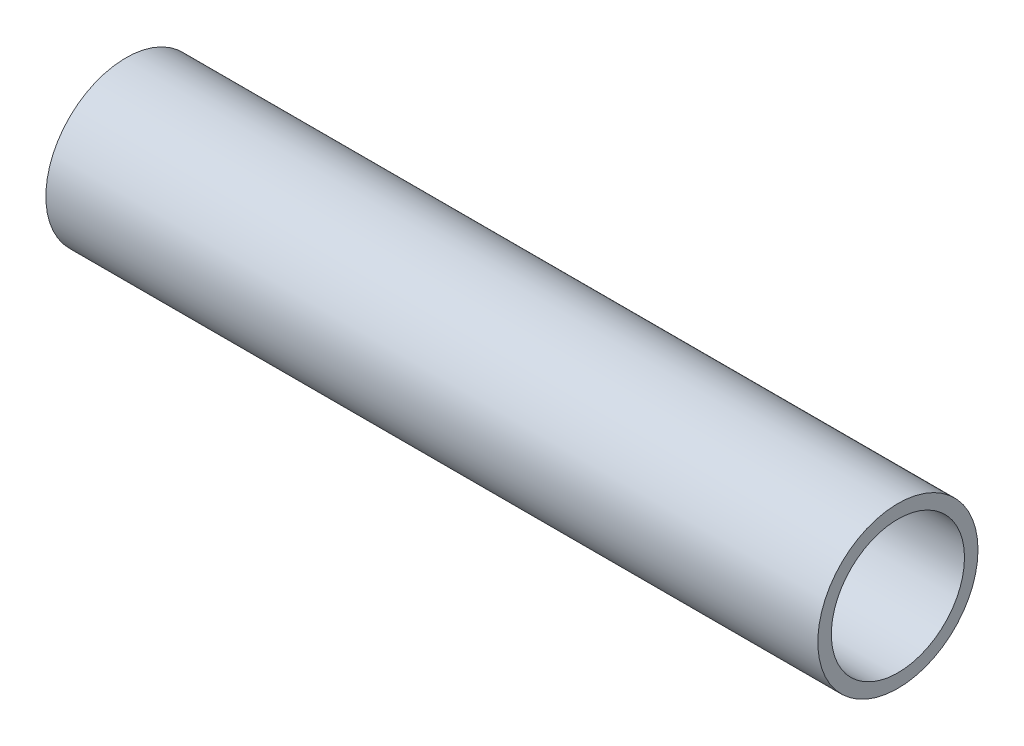
ISO-10303-21;
HEADER;
FILE_DESCRIPTION(('STEP AP214'),'2;1');
FILE_NAME('part.step','',(''),(''),'','','');
FILE_SCHEMA(('AUTOMOTIVE_DESIGN { 1 0 10303 214 1 1 1 1 }'));
ENDSEC;
DATA;
#1=APPLICATION_CONTEXT('core data for automotive mechanical design processes');
#2=APPLICATION_PROTOCOL_DEFINITION('international standard','automotive_design',2000,#1);
#3=PRODUCT_CONTEXT('',#1,'mechanical');
#4=PRODUCT('Part','Part','',(#3));
#5=PRODUCT_RELATED_PRODUCT_CATEGORY('part','',(#4));
#6=PRODUCT_DEFINITION_FORMATION('','',#4);
#7=PRODUCT_DEFINITION_CONTEXT('part definition',#1,'design');
#8=PRODUCT_DEFINITION('design','',#6,#7);
#9=PRODUCT_DEFINITION_SHAPE('','',#8);
#10=(LENGTH_UNIT() NAMED_UNIT(*) SI_UNIT(.MILLI.,.METRE.));
#11=(NAMED_UNIT(*) PLANE_ANGLE_UNIT() SI_UNIT($,.RADIAN.));
#12=(NAMED_UNIT(*) SI_UNIT($,.STERADIAN.) SOLID_ANGLE_UNIT());
#13=UNCERTAINTY_MEASURE_WITH_UNIT(LENGTH_MEASURE(1.E-05),#10,'distance_accuracy_value','');
#14=(GEOMETRIC_REPRESENTATION_CONTEXT(3) GLOBAL_UNCERTAINTY_ASSIGNED_CONTEXT((#13)) GLOBAL_UNIT_ASSIGNED_CONTEXT((#10,
#11,#12)) REPRESENTATION_CONTEXT('',''));
#15=CARTESIAN_POINT('',(0.,0.,0.));
#16=DIRECTION('',(0.,0.,1.));
#17=DIRECTION('',(1.,0.,0.));
#18=AXIS2_PLACEMENT_3D('',#15,#16,#17);
#19=CARTESIAN_POINT('',(23.8125,0.,0.));
#20=DIRECTION('',(0.,0.,-1.));
#21=DIRECTION('',(-1.,0.,0.));
#22=AXIS2_PLACEMENT_3D('',#19,#20,#21);
#23=CYLINDRICAL_SURFACE('',#22,2.4892);
#24=CARTESIAN_POINT('',(21.3233,0.,-17.526));
#25=CARTESIAN_POINT('',(21.3233062266169,-0.138938254931943,-17.5259977726248));
#26=CARTESIAN_POINT('',(21.3349813067063,-0.278056737041307,-17.5243291328847));
#27=CARTESIAN_POINT('',(21.3813911470445,-0.5525107717604,-17.5178292183779));
#28=CARTESIAN_POINT('',(21.4161734268432,-0.687837928648226,-17.512991426592));
#29=CARTESIAN_POINT('',(21.5077463863515,-0.950548988753154,-17.5006972156485));
#30=CARTESIAN_POINT('',(21.5645120778191,-1.07794172075063,-17.4932437705673));
#31=CARTESIAN_POINT('',(21.6983863175126,-1.32133653487949,-17.4765455887316));
#32=CARTESIAN_POINT('',(21.7754867392916,-1.4373431419368,-17.4673015679429));
#33=CARTESIAN_POINT('',(21.9484360487788,-1.65556227287108,-17.4479764750468));
#34=CARTESIAN_POINT('',(22.0444015414688,-1.75768195837013,-17.4378904336395));
#35=CARTESIAN_POINT('',(22.2521103856718,-1.94443010223313,-17.4180569830886));
#36=CARTESIAN_POINT('',(22.3638554036207,-2.02905671086871,-17.4083096098464));
#37=CARTESIAN_POINT('',(22.6005526819453,-2.1787595375816,-17.3902102827199));
#38=CARTESIAN_POINT('',(22.7255605656716,-2.2437486351899,-17.3818646180092));
#39=CARTESIAN_POINT('',(22.9848542436352,-2.35177419772773,-17.3675796065219));
#40=CARTESIAN_POINT('',(23.1191395034592,-2.39481192594698,-17.3616401212749));
#41=CARTESIAN_POINT('',(23.3922200685526,-2.45743213756116,-17.3528875502091));
#42=CARTESIAN_POINT('',(23.5309789813206,-2.47717037235337,-17.3500537131269));
#43=CARTESIAN_POINT('',(23.8098665327033,-2.49311360225913,-17.347770156121));
#44=CARTESIAN_POINT('',(23.9499951026768,-2.48931977072165,-17.3483202674678));
#45=CARTESIAN_POINT('',(24.2265474932383,-2.45843410030657,-17.3527234598054));
#46=CARTESIAN_POINT('',(24.3629910845748,-2.43151529098414,-17.3565520096389));
#47=CARTESIAN_POINT('',(24.6294060939256,-2.35541394562813,-17.3670424544746));
#48=CARTESIAN_POINT('',(24.7593772905789,-2.30623064871123,-17.3737044463084));
#49=CARTESIAN_POINT('',(25.0096911083541,-2.18681258648927,-17.3891387400983));
#50=CARTESIAN_POINT('',(25.1299976490672,-2.1165031963891,-17.3979185007095));
#51=CARTESIAN_POINT('',(25.3571607779271,-1.95688798280617,-17.4165926739363));
#52=CARTESIAN_POINT('',(25.4640176427523,-1.86758255019977,-17.4264870636145));
#53=CARTESIAN_POINT('',(25.6622435793958,-1.67157524535651,-17.4463829999866));
#54=CARTESIAN_POINT('',(25.7534686545121,-1.56472772059487,-17.4563847256321));
#55=CARTESIAN_POINT('',(25.9167550962461,-1.33710469447356,-17.4752924830594));
#56=CARTESIAN_POINT('',(25.988807768252,-1.21632290945262,-17.4841980167419));
#57=CARTESIAN_POINT('',(26.1117019761684,-0.964108046753343,-17.4999187345503));
#58=CARTESIAN_POINT('',(26.1625156561356,-0.832661249377181,-17.5067311703982));
#59=CARTESIAN_POINT('',(26.2412034012792,-0.563157851747397,-17.5174660851217));
#60=CARTESIAN_POINT('',(26.2691259522255,-0.425115880966423,-17.5213946704331));
#61=CARTESIAN_POINT('',(26.2907176883334,-0.238423058702268,-17.524443161174));
#62=CARTESIAN_POINT('',(26.294832866381,-0.190839329349158,-17.5250257692345));
#63=CARTESIAN_POINT('',(26.3003250932782,-0.0955108339760813,-17.5258045716289));
#64=CARTESIAN_POINT('',(26.3017021406704,-0.0477660678704195,-17.5260007657571));
#65=CARTESIAN_POINT('',(26.3016937733831,0.138938254931942,-17.5259977726248));
#66=CARTESIAN_POINT('',(26.2900186932937,0.278056737041305,-17.5243291328847));
#67=CARTESIAN_POINT('',(26.2436088529555,0.552510771760398,-17.5178292183779));
#68=CARTESIAN_POINT('',(26.2088265731568,0.687837928648224,-17.512991426592));
#69=CARTESIAN_POINT('',(26.1172536136485,0.950548988753152,-17.5006972156485));
#70=CARTESIAN_POINT('',(26.0604879221809,1.07794172075063,-17.4932437705673));
#71=CARTESIAN_POINT('',(25.9266136824874,1.32133653487949,-17.4765455887316));
#72=CARTESIAN_POINT('',(25.8495132607084,1.4373431419368,-17.4673015679429));
#73=CARTESIAN_POINT('',(25.6765639512212,1.65556227287108,-17.4479764750468));
#74=CARTESIAN_POINT('',(25.5805984585312,1.75768195837013,-17.4378904336395));
#75=CARTESIAN_POINT('',(25.3728896143282,1.94443010223313,-17.4180569830886));
#76=CARTESIAN_POINT('',(25.2611445963793,2.02905671086871,-17.4083096098464));
#77=CARTESIAN_POINT('',(25.0244473180547,2.1787595375816,-17.3902102827199));
#78=CARTESIAN_POINT('',(24.8994394343284,2.2437486351899,-17.3818646180092));
#79=CARTESIAN_POINT('',(24.6401457563648,2.35177419772773,-17.3675796065219));
#80=CARTESIAN_POINT('',(24.5058604965408,2.39481192594698,-17.3616401212749));
#81=CARTESIAN_POINT('',(24.2327799314474,2.45743213756116,-17.3528875502091));
#82=CARTESIAN_POINT('',(24.0940210186794,2.47717037235337,-17.3500537131269));
#83=CARTESIAN_POINT('',(23.8151334672967,2.49311360225913,-17.347770156121));
#84=CARTESIAN_POINT('',(23.6750048973232,2.48931977072165,-17.3483202674678));
#85=CARTESIAN_POINT('',(23.3984525067617,2.45843410030657,-17.3527234598054));
#86=CARTESIAN_POINT('',(23.2620089154252,2.43151529098414,-17.3565520096389));
#87=CARTESIAN_POINT('',(22.9955939060744,2.35541394562813,-17.3670424544746));
#88=CARTESIAN_POINT('',(22.8656227094211,2.30623064871123,-17.3737044463084));
#89=CARTESIAN_POINT('',(22.6153088916459,2.18681258648928,-17.3891387400983));
#90=CARTESIAN_POINT('',(22.4950023509328,2.1165031963891,-17.3979185007095));
#91=CARTESIAN_POINT('',(22.2678392220729,1.95688798280617,-17.4165926739363));
#92=CARTESIAN_POINT('',(22.1609823572477,1.86758255019977,-17.4264870636145));
#93=CARTESIAN_POINT('',(21.9627564206042,1.67157524535651,-17.4463829999866));
#94=CARTESIAN_POINT('',(21.8715313454879,1.56472772059487,-17.4563847256321));
#95=CARTESIAN_POINT('',(21.7082449037539,1.33710469447356,-17.4752924830594));
#96=CARTESIAN_POINT('',(21.636192231748,1.21632290945262,-17.4841980167419));
#97=CARTESIAN_POINT('',(21.5132980238316,0.964108046753344,-17.4999187345503));
#98=CARTESIAN_POINT('',(21.4624843438644,0.83266124937718,-17.5067311703982));
#99=CARTESIAN_POINT('',(21.3837965987208,0.563157851747397,-17.5174660851217));
#100=CARTESIAN_POINT('',(21.3558740477745,0.425115880966424,-17.5213946704331));
#101=CARTESIAN_POINT('',(21.3342823116666,0.238423058702268,-17.524443161174));
#102=CARTESIAN_POINT('',(21.330167133619,0.190839329349158,-17.5250257692345));
#103=CARTESIAN_POINT('',(21.3246749067218,0.0955108339760801,-17.5258045716289));
#104=CARTESIAN_POINT('',(21.3232978593296,0.0477660678704179,-17.5260007657571));
#105=CARTESIAN_POINT('',(21.3233,0.,-17.526));
#106=B_SPLINE_CURVE_WITH_KNOTS('',3,(#24,#25,#26,#27,#28,#29,#30,#31,#32,#33,#34,#35,#36,#37,
#38,#39,#40,#41,#42,#43,#44,#45,#46,#47,#48,#49,#50,#51,#52,#53,#54,#55,#56,#57,#58,#59,#60,#61,
#62,#63,#64,#65,#66,#67,#68,#69,#70,#71,#72,#73,#74,#75,#76,#77,#78,#79,#80,#81,#82,#83,#84,#85,
#86,#87,#88,#89,#90,#91,#92,#93,#94,#95,#96,#97,#98,#99,#100,#101,#102,#103,#104,#105),
.UNSPECIFIED.,.T.,.F.,(4,2,2,2,2,2,2,2,2,2,2,2,2,2,2,2,2,2,2,2,2,2,2,2,2,2,2,2,2,2,2,2,2,2,2,2,
2,2,2,2,4),(0.,0.416632621256299,0.834124703436849,1.25114361445184,1.66799612244714,
2.08751115533074,2.50707052531723,2.92846479975324,3.34983482043377,3.76837184084957,
4.18688799246334,4.60229965981692,5.01772552483293,5.43463642470698,5.85153874674943,
6.27209610359054,6.69284385779425,7.11414172405143,7.53454491553811,7.67778042315222,
7.82101600699993,8.23764862825623,8.65514071043678,9.07215962145176,9.48901212944707,
9.90852716233067,10.3280865323172,10.7494808067532,11.1708508274337,11.5893878478495,
12.0079039994633,12.4233156668168,12.8387415318328,13.2556524317069,13.6725547537494,
14.0931121105905,14.5138598647942,14.9351577310514,15.355560922538,15.4987964301521,
15.6420320139999),.UNSPECIFIED.);
#107=CARTESIAN_POINT('',(21.3233,0.,-17.526));
#108=VERTEX_POINT('',#107);
#109=EDGE_CURVE('E19',#108,#108,#106,.T.);
#110=ORIENTED_EDGE('',*,*,#109,.T.);
#111=EDGE_LOOP('',(#110));
#112=FACE_BOUND('',#111,.T.);
#113=CARTESIAN_POINT('',(26.3017,0.,-21.082));
#114=CARTESIAN_POINT('',(26.3016939093136,0.13917324253647,-21.0819981655476));
#115=CARTESIAN_POINT('',(26.2899795838816,0.278529433631494,-21.0806062227581));
#116=CARTESIAN_POINT('',(26.2434064099311,0.553464384706544,-21.0751843948127));
#117=CARTESIAN_POINT('',(26.208499288281,0.689034650147752,-21.0711490078797));
#118=CARTESIAN_POINT('',(26.1165753485475,0.952234680958764,-21.0608949848637));
#119=CARTESIAN_POINT('',(26.0595816147232,1.07987257591295,-21.0546786289036));
#120=CARTESIAN_POINT('',(25.9251488690771,1.32371155335375,-21.0407567449483));
#121=CARTESIAN_POINT('',(25.8477184835385,1.43991743293608,-21.0330518456322));
#122=CARTESIAN_POINT('',(25.6741860255696,1.65824366359407,-21.0169694889126));
#123=CARTESIAN_POINT('',(25.5780015098688,1.76029828618129,-21.008589161403));
#124=CARTESIAN_POINT('',(25.3698636589191,1.94686149327507,-20.9921234801541));
#125=CARTESIAN_POINT('',(25.2579087642175,2.03136834052416,-20.9840381556858));
#126=CARTESIAN_POINT('',(25.0210003728574,2.18066596797703,-20.9690506836339));
#127=CARTESIAN_POINT('',(24.8960092533975,2.24539743866397,-20.9621521218544));
#128=CARTESIAN_POINT('',(24.636836779057,2.35292726459425,-20.9503556287517));
#129=CARTESIAN_POINT('',(24.5026558165181,2.39572655552658,-20.9454576120813));
#130=CARTESIAN_POINT('',(24.2295758482469,2.45798388401387,-20.9382431663173));
#131=CARTESIAN_POINT('',(24.0907017987014,2.47754997869918,-20.9359147894799));
#132=CARTESIAN_POINT('',(23.8116228664883,2.49311975385867,-20.9340665629629));
#133=CARTESIAN_POINT('',(23.6714180296102,2.48912424212237,-20.9345466169986));
#134=CARTESIAN_POINT('',(23.3944095773965,2.45777309723949,-20.9382500748012));
#135=CARTESIAN_POINT('',(23.2575922890195,2.43053639079988,-20.9414595118558));
#136=CARTESIAN_POINT('',(22.9904828756884,2.35366098786401,-20.9502383704882));
#137=CARTESIAN_POINT('',(22.8601909280201,2.30402168308216,-20.9558078561469));
#138=CARTESIAN_POINT('',(22.6094565456649,2.18361936461013,-20.9686954057668));
#139=CARTESIAN_POINT('',(22.4890396571697,2.11280363705816,-20.9760178240728));
#140=CARTESIAN_POINT('',(22.2617641579912,1.95210261660065,-20.9915819783994));
#141=CARTESIAN_POINT('',(22.1549049972902,1.86221809768415,-20.9998236771006));
#142=CARTESIAN_POINT('',(21.9570955918468,1.66528844379043,-21.0163588445672));
#143=CARTESIAN_POINT('',(21.8662441854619,1.55814401335078,-21.0246523285127));
#144=CARTESIAN_POINT('',(21.7037583149481,1.33001488761703,-21.0403144982853));
#145=CARTESIAN_POINT('',(21.6321326799525,1.20902386975035,-21.0476827583939));
#146=CARTESIAN_POINT('',(21.5101404950765,0.956530753400546,-21.0606687789238));
#147=CARTESIAN_POINT('',(21.4597973876999,0.825017253075612,-21.0662846072851));
#148=CARTESIAN_POINT('',(21.3820408340219,0.555500835671919,-21.0751091304543));
#149=CARTESIAN_POINT('',(21.3545788189882,0.417512324356258,-21.0783229224621));
#150=CARTESIAN_POINT('',(21.3337112882718,0.232154861972339,-21.0807729691146));
#151=CARTESIAN_POINT('',(21.3298099821497,0.185816598413804,-21.0812321786978));
#152=CARTESIAN_POINT('',(21.3246033199595,0.0929923662024417,-21.0818460006914));
#153=CARTESIAN_POINT('',(21.3232979647246,0.046506397502218,-21.0820006130041));
#154=CARTESIAN_POINT('',(21.3233060906864,-0.139173242536472,-21.0819981655476));
#155=CARTESIAN_POINT('',(21.3350204161184,-0.278529433631496,-21.0806062227581));
#156=CARTESIAN_POINT('',(21.3815935900689,-0.553464384706546,-21.0751843948127));
#157=CARTESIAN_POINT('',(21.416500711719,-0.689034650147754,-21.0711490078797));
#158=CARTESIAN_POINT('',(21.5084246514525,-0.952234680958766,-21.0608949848637));
#159=CARTESIAN_POINT('',(21.5654183852768,-1.07987257591295,-21.0546786289036));
#160=CARTESIAN_POINT('',(21.6998511309229,-1.32371155335375,-21.0407567449483));
#161=CARTESIAN_POINT('',(21.7772815164615,-1.43991743293608,-21.0330518456322));
#162=CARTESIAN_POINT('',(21.9508139744304,-1.65824366359407,-21.0169694889126));
#163=CARTESIAN_POINT('',(22.0469984901312,-1.7602982861813,-21.008589161403));
#164=CARTESIAN_POINT('',(22.2551363410809,-1.94686149327508,-20.9921234801541));
#165=CARTESIAN_POINT('',(22.3670912357826,-2.03136834052417,-20.9840381556858));
#166=CARTESIAN_POINT('',(22.6039996271426,-2.18066596797703,-20.9690506836339));
#167=CARTESIAN_POINT('',(22.7289907466025,-2.24539743866397,-20.9621521218544));
#168=CARTESIAN_POINT('',(22.988163220943,-2.35292726459425,-20.9503556287517));
#169=CARTESIAN_POINT('',(23.1223441834819,-2.39572655552658,-20.9454576120813));
#170=CARTESIAN_POINT('',(23.3954241517531,-2.45798388401387,-20.9382431663173));
#171=CARTESIAN_POINT('',(23.5342982012986,-2.47754997869918,-20.9359147894799));
#172=CARTESIAN_POINT('',(23.8133771335117,-2.49311975385867,-20.9340665629629));
#173=CARTESIAN_POINT('',(23.9535819703898,-2.48912424212237,-20.9345466169986));
#174=CARTESIAN_POINT('',(24.2305904226035,-2.45777309723949,-20.9382500748012));
#175=CARTESIAN_POINT('',(24.3674077109805,-2.43053639079988,-20.9414595118558));
#176=CARTESIAN_POINT('',(24.6345171243116,-2.35366098786401,-20.9502383704882));
#177=CARTESIAN_POINT('',(24.7648090719799,-2.30402168308215,-20.9558078561469));
#178=CARTESIAN_POINT('',(25.0155434543351,-2.18361936461013,-20.9686954057668));
#179=CARTESIAN_POINT('',(25.1359603428303,-2.11280363705816,-20.9760178240728));
#180=CARTESIAN_POINT('',(25.3632358420088,-1.95210261660065,-20.9915819783994));
#181=CARTESIAN_POINT('',(25.4700950027098,-1.86221809768415,-20.9998236771006));
#182=CARTESIAN_POINT('',(25.6679044081532,-1.66528844379043,-21.0163588445672));
#183=CARTESIAN_POINT('',(25.7587558145381,-1.55814401335078,-21.0246523285127));
#184=CARTESIAN_POINT('',(25.9212416850519,-1.33001488761702,-21.0403144982853));
#185=CARTESIAN_POINT('',(25.9928673200475,-1.20902386975035,-21.0476827583939));
#186=CARTESIAN_POINT('',(26.1148595049235,-0.956530753400542,-21.0606687789238));
#187=CARTESIAN_POINT('',(26.1652026123001,-0.825017253075607,-21.0662846072851));
#188=CARTESIAN_POINT('',(26.2429591659781,-0.555500835671915,-21.0751091304543));
#189=CARTESIAN_POINT('',(26.2704211810119,-0.417512324356256,-21.0783229224621));
#190=CARTESIAN_POINT('',(26.2912887117282,-0.232154861972337,-21.0807729691146));
#191=CARTESIAN_POINT('',(26.2951900178503,-0.185816598413804,-21.0812321786978));
#192=CARTESIAN_POINT('',(26.3003966800405,-0.0929923662024424,-21.0818460006914));
#193=CARTESIAN_POINT('',(26.3017020352754,-0.0465063975022194,-21.0820006130041));
#194=CARTESIAN_POINT('',(26.3017,0.,-21.082));
#195=B_SPLINE_CURVE_WITH_KNOTS('',3,(#113,#114,#115,#116,#117,#118,#119,#120,#121,#122,#123,
#124,#125,#126,#127,#128,#129,#130,#131,#132,#133,#134,#135,#136,#137,#138,#139,#140,#141,#142,
#143,#144,#145,#146,#147,#148,#149,#150,#151,#152,#153,#154,#155,#156,#157,#158,#159,#160,#161,
#162,#163,#164,#165,#166,#167,#168,#169,#170,#171,#172,#173,#174,#175,#176,#177,#178,#179,#180,
#181,#182,#183,#184,#185,#186,#187,#188,#189,#190,#191,#192,#193,#194),.UNSPECIFIED.,.T.,.F.,(4,
2,2,2,2,2,2,2,2,2,2,2,2,2,2,2,2,2,2,2,2,2,2,2,2,2,2,2,2,2,2,2,2,2,2,2,2,2,2,2,4),(0.,
0.417342531698613,0.835556446393463,1.25333443033391,1.67093635198848,2.09041721847861,
2.50993959445756,2.93070810484587,3.35145866256164,3.77024455574891,4.1890160913035,
4.60565750829793,5.02231023881106,5.44000888913396,5.85769058860035,6.27786714988648,
6.69823634180109,7.11906736753133,7.53900282062446,7.6784627562516,7.81792273663304,
8.23526526833165,8.6534791830265,9.07125716696695,9.48885908862152,9.90833995511165,
10.3278623310906,10.7486308414789,11.1693813991947,11.5881672923819,12.0069388279365,
12.423580244931,12.8402329754441,13.257931625767,13.6756133252334,14.0957898865195,
14.5161590784341,14.9369901041644,15.3569255572575,15.4963854928846,15.6358454732661),.UNSPECIFIED.);
#196=CARTESIAN_POINT('',(26.3017,0.,-21.082));
#197=VERTEX_POINT('',#196);
#198=EDGE_CURVE('E42',#197,#197,#195,.T.);
#199=ORIENTED_EDGE('',*,*,#198,.F.);
#200=EDGE_LOOP('',(#199));
#201=FACE_BOUND('',#200,.T.);
#202=ADVANCED_FACE('F15',(#112,#201),#23,.F.);
#203=CARTESIAN_POINT('',(-23.8125,0.,0.));
#204=DIRECTION('',(0.,0.,1.));
#205=DIRECTION('',(1.,0.,0.));
#206=AXIS2_PLACEMENT_3D('',#203,#204,#205);
#207=CYLINDRICAL_SURFACE('',#206,2.4892);
#208=CARTESIAN_POINT('',(-21.3233,0.,-21.082));
#209=CARTESIAN_POINT('',(-21.3233060906864,0.13917324253647,-21.0819981655476));
#210=CARTESIAN_POINT('',(-21.3350204161184,0.278529433631494,-21.0806062227581));
#211=CARTESIAN_POINT('',(-21.3815935900689,0.553464384706544,-21.0751843948127));
#212=CARTESIAN_POINT('',(-21.416500711719,0.689034650147752,-21.0711490078797));
#213=CARTESIAN_POINT('',(-21.5084246514525,0.952234680958762,-21.0608949848637));
#214=CARTESIAN_POINT('',(-21.5654183852768,1.07987257591295,-21.0546786289036));
#215=CARTESIAN_POINT('',(-21.6998511309229,1.32371155335375,-21.0407567449483));
#216=CARTESIAN_POINT('',(-21.7772815164615,1.43991743293608,-21.0330518456322));
#217=CARTESIAN_POINT('',(-21.9508139744304,1.65824366359407,-21.0169694889126));
#218=CARTESIAN_POINT('',(-22.0469984901312,1.76029828618129,-21.008589161403));
#219=CARTESIAN_POINT('',(-22.2551363410809,1.94686149327507,-20.9921234801541));
#220=CARTESIAN_POINT('',(-22.3670912357825,2.03136834052416,-20.9840381556858));
#221=CARTESIAN_POINT('',(-22.6039996271426,2.18066596797703,-20.9690506836339));
#222=CARTESIAN_POINT('',(-22.7289907466025,2.24539743866396,-20.9621521218544));
#223=CARTESIAN_POINT('',(-22.988163220943,2.35292726459425,-20.9503556287517));
#224=CARTESIAN_POINT('',(-23.1223441834819,2.39572655552658,-20.9454576120813));
#225=CARTESIAN_POINT('',(-23.395424151753,2.45798388401387,-20.9382431663173));
#226=CARTESIAN_POINT('',(-23.5342982012986,2.47754997869918,-20.9359147894799));
#227=CARTESIAN_POINT('',(-23.8133771335117,2.49311975385867,-20.9340665629629));
#228=CARTESIAN_POINT('',(-23.9535819703898,2.48912424212237,-20.9345466169986));
#229=CARTESIAN_POINT('',(-24.2305904226035,2.45777309723949,-20.9382500748012));
#230=CARTESIAN_POINT('',(-24.3674077109805,2.43053639079988,-20.9414595118558));
#231=CARTESIAN_POINT('',(-24.6345171243116,2.35366098786401,-20.9502383704882));
#232=CARTESIAN_POINT('',(-24.7648090719799,2.30402168308216,-20.9558078561469));
#233=CARTESIAN_POINT('',(-25.0155434543351,2.18361936461013,-20.9686954057668));
#234=CARTESIAN_POINT('',(-25.1359603428303,2.11280363705816,-20.9760178240728));
#235=CARTESIAN_POINT('',(-25.3632358420088,1.95210261660065,-20.9915819783994));
#236=CARTESIAN_POINT('',(-25.4700950027098,1.86221809768415,-20.9998236771006));
#237=CARTESIAN_POINT('',(-25.6679044081532,1.66528844379043,-21.0163588445672));
#238=CARTESIAN_POINT('',(-25.7587558145381,1.55814401335078,-21.0246523285127));
#239=CARTESIAN_POINT('',(-25.9212416850519,1.33001488761703,-21.0403144982853));
#240=CARTESIAN_POINT('',(-25.9928673200475,1.20902386975035,-21.0476827583939));
#241=CARTESIAN_POINT('',(-26.1148595049235,0.956530753400546,-21.0606687789238));
#242=CARTESIAN_POINT('',(-26.1652026123001,0.825017253075611,-21.0662846072851));
#243=CARTESIAN_POINT('',(-26.2429591659781,0.555500835671919,-21.0751091304543));
#244=CARTESIAN_POINT('',(-26.2704211810118,0.417512324356258,-21.0783229224621));
#245=CARTESIAN_POINT('',(-26.2912887117282,0.232154861972339,-21.0807729691146));
#246=CARTESIAN_POINT('',(-26.2951900178503,0.185816598413805,-21.0812321786978));
#247=CARTESIAN_POINT('',(-26.3003966800405,0.0929923662024421,-21.0818460006914));
#248=CARTESIAN_POINT('',(-26.3017020352754,0.0465063975022183,-21.0820006130041));
#249=CARTESIAN_POINT('',(-26.3016939093136,-0.139173242536472,-21.0819981655476));
#250=CARTESIAN_POINT('',(-26.2899795838816,-0.278529433631496,-21.0806062227581));
#251=CARTESIAN_POINT('',(-26.2434064099311,-0.553464384706546,-21.0751843948127));
#252=CARTESIAN_POINT('',(-26.208499288281,-0.689034650147754,-21.0711490078797));
#253=CARTESIAN_POINT('',(-26.1165753485475,-0.952234680958765,-21.0608949848637));
#254=CARTESIAN_POINT('',(-26.0595816147232,-1.07987257591295,-21.0546786289036));
#255=CARTESIAN_POINT('',(-25.9251488690771,-1.32371155335375,-21.0407567449483));
#256=CARTESIAN_POINT('',(-25.8477184835385,-1.43991743293608,-21.0330518456322));
#257=CARTESIAN_POINT('',(-25.6741860255696,-1.65824366359407,-21.0169694889126));
#258=CARTESIAN_POINT('',(-25.5780015098688,-1.7602982861813,-21.008589161403));
#259=CARTESIAN_POINT('',(-25.3698636589191,-1.94686149327507,-20.9921234801541));
#260=CARTESIAN_POINT('',(-25.2579087642174,-2.03136834052417,-20.9840381556858));
#261=CARTESIAN_POINT('',(-25.0210003728574,-2.18066596797703,-20.9690506836339));
#262=CARTESIAN_POINT('',(-24.8960092533975,-2.24539743866397,-20.9621521218544));
#263=CARTESIAN_POINT('',(-24.636836779057,-2.35292726459425,-20.9503556287517));
#264=CARTESIAN_POINT('',(-24.5026558165181,-2.39572655552658,-20.9454576120813));
#265=CARTESIAN_POINT('',(-24.2295758482469,-2.45798388401387,-20.9382431663173));
#266=CARTESIAN_POINT('',(-24.0907017987014,-2.47754997869918,-20.9359147894799));
#267=CARTESIAN_POINT('',(-23.8116228664883,-2.49311975385867,-20.9340665629629));
#268=CARTESIAN_POINT('',(-23.6714180296102,-2.48912424212237,-20.9345466169986));
#269=CARTESIAN_POINT('',(-23.3944095773965,-2.45777309723949,-20.9382500748012));
#270=CARTESIAN_POINT('',(-23.2575922890195,-2.43053639079988,-20.9414595118558));
#271=CARTESIAN_POINT('',(-22.9904828756884,-2.35366098786401,-20.9502383704882));
#272=CARTESIAN_POINT('',(-22.8601909280201,-2.30402168308216,-20.9558078561469));
#273=CARTESIAN_POINT('',(-22.6094565456649,-2.18361936461013,-20.9686954057668));
#274=CARTESIAN_POINT('',(-22.4890396571697,-2.11280363705816,-20.9760178240728));
#275=CARTESIAN_POINT('',(-22.2617641579912,-1.95210261660065,-20.9915819783994));
#276=CARTESIAN_POINT('',(-22.1549049972902,-1.86221809768415,-20.9998236771006));
#277=CARTESIAN_POINT('',(-21.9570955918468,-1.66528844379043,-21.0163588445672));
#278=CARTESIAN_POINT('',(-21.8662441854619,-1.55814401335078,-21.0246523285127));
#279=CARTESIAN_POINT('',(-21.7037583149481,-1.33001488761702,-21.0403144982853));
#280=CARTESIAN_POINT('',(-21.6321326799525,-1.20902386975035,-21.0476827583939));
#281=CARTESIAN_POINT('',(-21.5101404950765,-0.956530753400541,-21.0606687789238));
#282=CARTESIAN_POINT('',(-21.4597973876999,-0.825017253075606,-21.0662846072851));
#283=CARTESIAN_POINT('',(-21.3820408340219,-0.555500835671915,-21.0751091304543));
#284=CARTESIAN_POINT('',(-21.3545788189881,-0.417512324356256,-21.0783229224621));
#285=CARTESIAN_POINT('',(-21.3337112882718,-0.232154861972337,-21.0807729691146));
#286=CARTESIAN_POINT('',(-21.3298099821497,-0.185816598413804,-21.0812321786978));
#287=CARTESIAN_POINT('',(-21.3246033199595,-0.0929923662024426,-21.0818460006914));
#288=CARTESIAN_POINT('',(-21.3232979647246,-0.0465063975022197,-21.0820006130041));
#289=CARTESIAN_POINT('',(-21.3233,0.,-21.082));
#290=B_SPLINE_CURVE_WITH_KNOTS('',3,(#208,#209,#210,#211,#212,#213,#214,#215,#216,#217,#218,
#219,#220,#221,#222,#223,#224,#225,#226,#227,#228,#229,#230,#231,#232,#233,#234,#235,#236,#237,
#238,#239,#240,#241,#242,#243,#244,#245,#246,#247,#248,#249,#250,#251,#252,#253,#254,#255,#256,
#257,#258,#259,#260,#261,#262,#263,#264,#265,#266,#267,#268,#269,#270,#271,#272,#273,#274,#275,
#276,#277,#278,#279,#280,#281,#282,#283,#284,#285,#286,#287,#288,#289),.UNSPECIFIED.,.T.,.F.,(4,
2,2,2,2,2,2,2,2,2,2,2,2,2,2,2,2,2,2,2,2,2,2,2,2,2,2,2,2,2,2,2,2,2,2,2,2,2,2,2,4),(0.,
0.417342531698613,0.835556446393463,1.25333443033391,1.67093635198848,2.0904172184786,
2.50993959445756,2.93070810484587,3.35145866256164,3.7702445557489,4.1890160913035,
4.60565750829793,5.02231023881106,5.44000888913396,5.85769058860035,6.27786714988648,
6.69823634180109,7.11906736753133,7.53900282062446,7.67846275625159,7.81792273663304,
8.23526526833165,8.6534791830265,9.07125716696695,9.48885908862152,9.90833995511165,
10.3278623310906,10.7486308414789,11.1693813991947,11.5881672923819,12.0069388279365,
12.423580244931,12.8402329754441,13.257931625767,13.6756133252334,14.0957898865195,
14.5161590784341,14.9369901041644,15.3569255572575,15.4963854928846,15.6358454732661),.UNSPECIFIED.);
#291=CARTESIAN_POINT('',(-21.3233,0.,-21.082));
#292=VERTEX_POINT('',#291);
#293=EDGE_CURVE('E36',#292,#292,#290,.T.);
#294=ORIENTED_EDGE('',*,*,#293,.F.);
#295=EDGE_LOOP('',(#294));
#296=FACE_BOUND('',#295,.T.);
#297=CARTESIAN_POINT('',(-26.3017,0.,-17.526));
#298=CARTESIAN_POINT('',(-26.3016937733831,-0.138938254931943,-17.5259977726248));
#299=CARTESIAN_POINT('',(-26.2900186932937,-0.278056737041307,-17.5243291328847));
#300=CARTESIAN_POINT('',(-26.2436088529555,-0.552510771760399,-17.5178292183779));
#301=CARTESIAN_POINT('',(-26.2088265731568,-0.687837928648225,-17.512991426592));
#302=CARTESIAN_POINT('',(-26.1172536136485,-0.950548988753153,-17.5006972156485));
#303=CARTESIAN_POINT('',(-26.0604879221809,-1.07794172075063,-17.4932437705673));
#304=CARTESIAN_POINT('',(-25.9266136824874,-1.32133653487949,-17.4765455887316));
#305=CARTESIAN_POINT('',(-25.8495132607084,-1.4373431419368,-17.4673015679429));
#306=CARTESIAN_POINT('',(-25.6765639512212,-1.65556227287108,-17.4479764750468));
#307=CARTESIAN_POINT('',(-25.5805984585312,-1.75768195837013,-17.4378904336395));
#308=CARTESIAN_POINT('',(-25.3728896143282,-1.94443010223313,-17.4180569830886));
#309=CARTESIAN_POINT('',(-25.2611445963793,-2.02905671086871,-17.4083096098464));
#310=CARTESIAN_POINT('',(-25.0244473180547,-2.17875953758159,-17.3902102827199));
#311=CARTESIAN_POINT('',(-24.8994394343284,-2.2437486351899,-17.3818646180092));
#312=CARTESIAN_POINT('',(-24.6401457563648,-2.35177419772773,-17.3675796065219));
#313=CARTESIAN_POINT('',(-24.5058604965408,-2.39481192594698,-17.3616401212749));
#314=CARTESIAN_POINT('',(-24.2327799314474,-2.45743213756116,-17.3528875502091));
#315=CARTESIAN_POINT('',(-24.0940210186794,-2.47717037235337,-17.3500537131269));
#316=CARTESIAN_POINT('',(-23.8151334672967,-2.49311360225913,-17.347770156121));
#317=CARTESIAN_POINT('',(-23.6750048973232,-2.48931977072165,-17.3483202674678));
#318=CARTESIAN_POINT('',(-23.3984525067617,-2.45843410030657,-17.3527234598054));
#319=CARTESIAN_POINT('',(-23.2620089154252,-2.43151529098414,-17.3565520096389));
#320=CARTESIAN_POINT('',(-22.9955939060744,-2.35541394562813,-17.3670424544746));
#321=CARTESIAN_POINT('',(-22.8656227094211,-2.30623064871123,-17.3737044463084));
#322=CARTESIAN_POINT('',(-22.6153088916459,-2.18681258648928,-17.3891387400983));
#323=CARTESIAN_POINT('',(-22.4950023509328,-2.1165031963891,-17.3979185007095));
#324=CARTESIAN_POINT('',(-22.2678392220729,-1.95688798280617,-17.4165926739363));
#325=CARTESIAN_POINT('',(-22.1609823572477,-1.86758255019977,-17.4264870636145));
#326=CARTESIAN_POINT('',(-21.9627564206042,-1.67157524535651,-17.4463829999866));
#327=CARTESIAN_POINT('',(-21.8715313454879,-1.56472772059487,-17.4563847256321));
#328=CARTESIAN_POINT('',(-21.7082449037539,-1.33710469447356,-17.4752924830594));
#329=CARTESIAN_POINT('',(-21.636192231748,-1.21632290945262,-17.4841980167419));
#330=CARTESIAN_POINT('',(-21.5132980238316,-0.964108046753342,-17.4999187345503));
#331=CARTESIAN_POINT('',(-21.4624843438644,-0.832661249377179,-17.5067311703982));
#332=CARTESIAN_POINT('',(-21.3837965987208,-0.563157851747395,-17.5174660851217));
#333=CARTESIAN_POINT('',(-21.3558740477745,-0.425115880966423,-17.5213946704331));
#334=CARTESIAN_POINT('',(-21.3342823116666,-0.238423058702268,-17.524443161174));
#335=CARTESIAN_POINT('',(-21.330167133619,-0.190839329349158,-17.5250257692345));
#336=CARTESIAN_POINT('',(-21.3246749067218,-0.0955108339760816,-17.5258045716289));
#337=CARTESIAN_POINT('',(-21.3232978593296,-0.0477660678704197,-17.5260007657571));
#338=CARTESIAN_POINT('',(-21.3233062266169,0.138938254931941,-17.5259977726248));
#339=CARTESIAN_POINT('',(-21.3349813067063,0.278056737041304,-17.5243291328847));
#340=CARTESIAN_POINT('',(-21.3813911470445,0.552510771760397,-17.5178292183779));
#341=CARTESIAN_POINT('',(-21.4161734268432,0.687837928648223,-17.512991426592));
#342=CARTESIAN_POINT('',(-21.5077463863515,0.950548988753152,-17.5006972156485));
#343=CARTESIAN_POINT('',(-21.5645120778191,1.07794172075063,-17.4932437705673));
#344=CARTESIAN_POINT('',(-21.6983863175126,1.32133653487949,-17.4765455887316));
#345=CARTESIAN_POINT('',(-21.7754867392916,1.4373431419368,-17.4673015679429));
#346=CARTESIAN_POINT('',(-21.9484360487788,1.65556227287108,-17.4479764750468));
#347=CARTESIAN_POINT('',(-22.0444015414688,1.75768195837013,-17.4378904336395));
#348=CARTESIAN_POINT('',(-22.2521103856718,1.94443010223313,-17.4180569830886));
#349=CARTESIAN_POINT('',(-22.3638554036207,2.02905671086871,-17.4083096098464));
#350=CARTESIAN_POINT('',(-22.6005526819453,2.17875953758159,-17.3902102827199));
#351=CARTESIAN_POINT('',(-22.7255605656716,2.2437486351899,-17.3818646180092));
#352=CARTESIAN_POINT('',(-22.9848542436352,2.35177419772773,-17.3675796065219));
#353=CARTESIAN_POINT('',(-23.1191395034592,2.39481192594698,-17.3616401212749));
#354=CARTESIAN_POINT('',(-23.3922200685526,2.45743213756116,-17.3528875502091));
#355=CARTESIAN_POINT('',(-23.5309789813206,2.47717037235337,-17.3500537131269));
#356=CARTESIAN_POINT('',(-23.8098665327033,2.49311360225913,-17.347770156121));
#357=CARTESIAN_POINT('',(-23.9499951026768,2.48931977072165,-17.3483202674678));
#358=CARTESIAN_POINT('',(-24.2265474932383,2.45843410030657,-17.3527234598054));
#359=CARTESIAN_POINT('',(-24.3629910845748,2.43151529098414,-17.3565520096389));
#360=CARTESIAN_POINT('',(-24.6294060939256,2.35541394562813,-17.3670424544746));
#361=CARTESIAN_POINT('',(-24.7593772905789,2.30623064871123,-17.3737044463084));
#362=CARTESIAN_POINT('',(-25.0096911083541,2.18681258648928,-17.3891387400983));
#363=CARTESIAN_POINT('',(-25.1299976490672,2.1165031963891,-17.3979185007095));
#364=CARTESIAN_POINT('',(-25.3571607779271,1.95688798280617,-17.4165926739363));
#365=CARTESIAN_POINT('',(-25.4640176427523,1.86758255019977,-17.4264870636145));
#366=CARTESIAN_POINT('',(-25.6622435793958,1.67157524535651,-17.4463829999866));
#367=CARTESIAN_POINT('',(-25.7534686545121,1.56472772059487,-17.4563847256321));
#368=CARTESIAN_POINT('',(-25.9167550962461,1.33710469447357,-17.4752924830594));
#369=CARTESIAN_POINT('',(-25.988807768252,1.21632290945263,-17.4841980167419));
#370=CARTESIAN_POINT('',(-26.1117019761684,0.964108046753346,-17.4999187345503));
#371=CARTESIAN_POINT('',(-26.1625156561356,0.832661249377182,-17.5067311703982));
#372=CARTESIAN_POINT('',(-26.2412034012792,0.563157851747397,-17.5174660851217));
#373=CARTESIAN_POINT('',(-26.2691259522255,0.425115880966424,-17.5213946704331));
#374=CARTESIAN_POINT('',(-26.2907176883334,0.238423058702269,-17.524443161174));
#375=CARTESIAN_POINT('',(-26.294832866381,0.190839329349159,-17.5250257692345));
#376=CARTESIAN_POINT('',(-26.3003250932782,0.0955108339760813,-17.5258045716289));
#377=CARTESIAN_POINT('',(-26.3017021406704,0.0477660678704187,-17.5260007657571));
#378=CARTESIAN_POINT('',(-26.3017,0.,-17.526));
#379=B_SPLINE_CURVE_WITH_KNOTS('',3,(#297,#298,#299,#300,#301,#302,#303,#304,#305,#306,#307,
#308,#309,#310,#311,#312,#313,#314,#315,#316,#317,#318,#319,#320,#321,#322,#323,#324,#325,#326,
#327,#328,#329,#330,#331,#332,#333,#334,#335,#336,#337,#338,#339,#340,#341,#342,#343,#344,#345,
#346,#347,#348,#349,#350,#351,#352,#353,#354,#355,#356,#357,#358,#359,#360,#361,#362,#363,#364,
#365,#366,#367,#368,#369,#370,#371,#372,#373,#374,#375,#376,#377,#378),.UNSPECIFIED.,.T.,.F.,(4,
2,2,2,2,2,2,2,2,2,2,2,2,2,2,2,2,2,2,2,2,2,2,2,2,2,2,2,2,2,2,2,2,2,2,2,2,2,2,2,4),(0.,
0.416632621256299,0.834124703436848,1.25114361445183,1.66799612244714,2.08751115533074,
2.50707052531723,2.92846479975324,3.34983482043377,3.76837184084957,4.18688799246334,
4.60229965981692,5.01772552483292,5.43463642470699,5.85153874674943,6.27209610359054,
6.69284385779425,7.11414172405143,7.53454491553811,7.67778042315222,7.82101600699993,
8.23764862825623,8.65514071043678,9.07215962145176,9.48901212944707,9.90852716233067,
10.3280865323172,10.7494808067532,11.1708508274337,11.5893878478495,12.0079039994633,
12.4233156668168,12.8387415318329,13.2556524317069,13.6725547537494,14.0931121105905,
14.5138598647942,14.9351577310514,15.355560922538,15.4987964301521,15.6420320139999),.UNSPECIFIED.);
#380=CARTESIAN_POINT('',(-26.3017,0.,-17.526));
#381=VERTEX_POINT('',#380);
#382=EDGE_CURVE('E66',#381,#381,#379,.T.);
#383=ORIENTED_EDGE('',*,*,#382,.T.);
#384=EDGE_LOOP('',(#383));
#385=FACE_BOUND('',#384,.T.);
#386=ADVANCED_FACE('F46',(#296,#385),#207,.F.);
#387=CARTESIAN_POINT('',(-101.6,0.,0.));
#388=DIRECTION('',(1.,0.,0.));
#389=DIRECTION('',(0.,0.,-1.));
#390=AXIS2_PLACEMENT_3D('',#387,#388,#389);
#391=CYLINDRICAL_SURFACE('',#390,17.526);
#392=CARTESIAN_POINT('',(101.6,0.,0.));
#393=DIRECTION('',(1.,0.,0.));
#394=DIRECTION('',(0.,0.,-1.));
#395=AXIS2_PLACEMENT_3D('',#392,#393,#394);
#396=CIRCLE('',#395,17.526);
#397=CARTESIAN_POINT('',(101.6,0.,-17.526));
#398=VERTEX_POINT('',#397);
#399=EDGE_CURVE('E70',#398,#398,#396,.F.);
#400=ORIENTED_EDGE('',*,*,#399,.F.);
#401=EDGE_LOOP('',(#400));
#402=FACE_BOUND('',#401,.T.);
#403=ORIENTED_EDGE('',*,*,#382,.F.);
#404=EDGE_LOOP('',(#403));
#405=FACE_BOUND('',#404,.T.);
#406=ORIENTED_EDGE('',*,*,#109,.F.);
#407=EDGE_LOOP('',(#406));
#408=FACE_BOUND('',#407,.T.);
#409=CARTESIAN_POINT('',(-101.6,0.,0.));
#410=DIRECTION('',(1.,0.,0.));
#411=DIRECTION('',(0.,0.,-1.));
#412=AXIS2_PLACEMENT_3D('',#409,#410,#411);
#413=CIRCLE('',#412,17.526);
#414=CARTESIAN_POINT('',(-101.6,0.,-17.526));
#415=VERTEX_POINT('',#414);
#416=EDGE_CURVE('E31',#415,#415,#413,.F.);
#417=ORIENTED_EDGE('',*,*,#416,.T.);
#418=EDGE_LOOP('',(#417));
#419=FACE_BOUND('',#418,.T.);
#420=ADVANCED_FACE('F60',(#402,#405,#408,#419),#391,.F.);
#421=CARTESIAN_POINT('',(101.6,0.,0.));
#422=DIRECTION('',(1.,0.,0.));
#423=DIRECTION('',(0.,0.,-1.));
#424=AXIS2_PLACEMENT_3D('',#421,#422,#423);
#425=PLANE('',#424);
#426=ORIENTED_EDGE('',*,*,#399,.T.);
#427=EDGE_LOOP('',(#426));
#428=FACE_BOUND('',#427,.T.);
#429=CARTESIAN_POINT('',(101.6,0.,0.));
#430=DIRECTION('',(1.,0.,0.));
#431=DIRECTION('',(0.,0.,-1.));
#432=AXIS2_PLACEMENT_3D('',#429,#430,#431);
#433=CIRCLE('',#432,21.082);
#434=CARTESIAN_POINT('',(101.6,0.,-21.082));
#435=VERTEX_POINT('',#434);
#436=EDGE_CURVE('E26',#435,#435,#433,.F.);
#437=ORIENTED_EDGE('',*,*,#436,.F.);
#438=EDGE_LOOP('',(#437));
#439=FACE_BOUND('',#438,.T.);
#440=ADVANCED_FACE('F57',(#428,#439),#425,.T.);
#441=CARTESIAN_POINT('',(-101.6,0.,0.));
#442=DIRECTION('',(1.,0.,0.));
#443=DIRECTION('',(0.,0.,-1.));
#444=AXIS2_PLACEMENT_3D('',#441,#442,#443);
#445=PLANE('',#444);
#446=ORIENTED_EDGE('',*,*,#416,.F.);
#447=EDGE_LOOP('',(#446));
#448=FACE_BOUND('',#447,.T.);
#449=CARTESIAN_POINT('',(-101.6,0.,0.));
#450=DIRECTION('',(1.,0.,0.));
#451=DIRECTION('',(0.,0.,-1.));
#452=AXIS2_PLACEMENT_3D('',#449,#450,#451);
#453=CIRCLE('',#452,21.082);
#454=CARTESIAN_POINT('',(-101.6,0.,-21.082));
#455=VERTEX_POINT('',#454);
#456=EDGE_CURVE('E10',#455,#455,#453,.T.);
#457=ORIENTED_EDGE('',*,*,#456,.F.);
#458=EDGE_LOOP('',(#457));
#459=FACE_BOUND('',#458,.T.);
#460=ADVANCED_FACE('F52',(#448,#459),#445,.F.);
#461=CARTESIAN_POINT('',(-101.6,0.,0.));
#462=DIRECTION('',(1.,0.,0.));
#463=DIRECTION('',(0.,0.,-1.));
#464=AXIS2_PLACEMENT_3D('',#461,#462,#463);
#465=CYLINDRICAL_SURFACE('',#464,21.082);
#466=ORIENTED_EDGE('',*,*,#436,.T.);
#467=EDGE_LOOP('',(#466));
#468=FACE_BOUND('',#467,.T.);
#469=ORIENTED_EDGE('',*,*,#456,.T.);
#470=EDGE_LOOP('',(#469));
#471=FACE_BOUND('',#470,.T.);
#472=ORIENTED_EDGE('',*,*,#293,.T.);
#473=EDGE_LOOP('',(#472));
#474=FACE_BOUND('',#473,.T.);
#475=ORIENTED_EDGE('',*,*,#198,.T.);
#476=EDGE_LOOP('',(#475));
#477=FACE_BOUND('',#476,.T.);
#478=ADVANCED_FACE('F48',(#468,#471,#474,#477),#465,.T.);
#479=CLOSED_SHELL('',(#202,#386,#420,#440,#460,#478));
#480=MANIFOLD_SOLID_BREP('B1',#479);
#481=ADVANCED_BREP_SHAPE_REPRESENTATION('',(#18,#480),#14);
#482=SHAPE_DEFINITION_REPRESENTATION(#9,#481);
ENDSEC;
END-ISO-10303-21;
